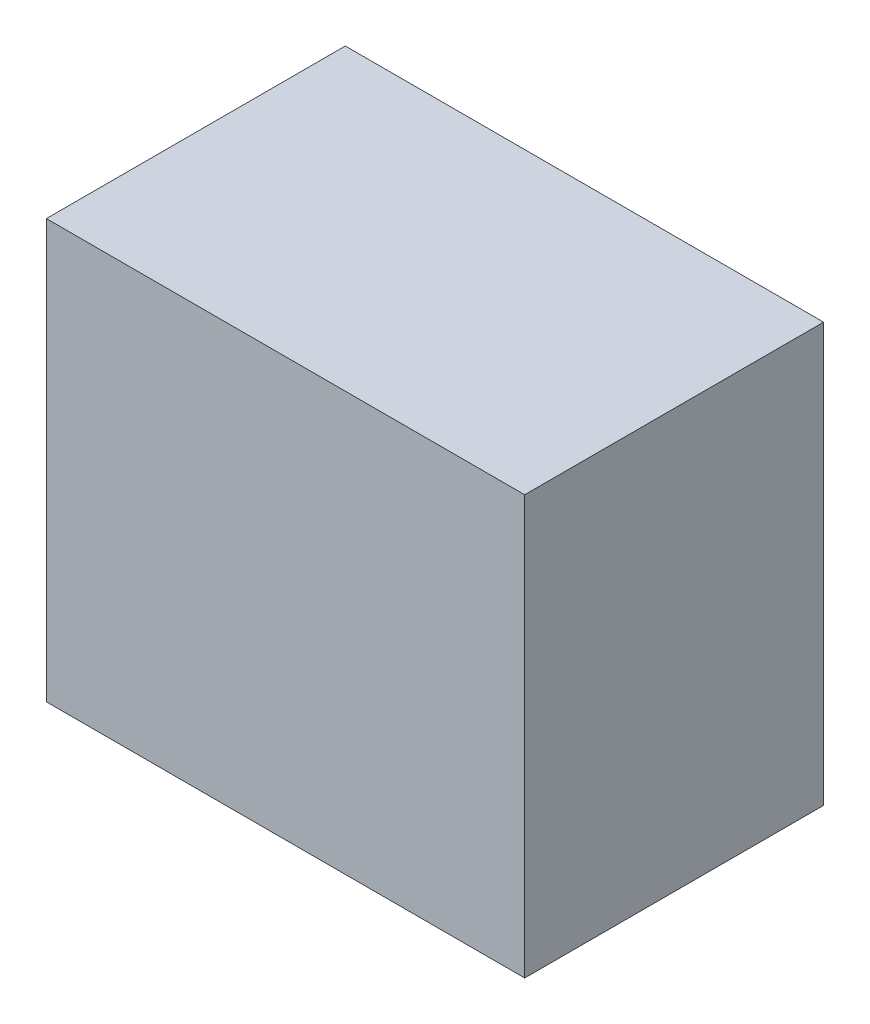
ISO-10303-21;
HEADER;
FILE_DESCRIPTION(('STEP AP214'),'2;1');
FILE_NAME('part.step','',(''),(''),'','','');
FILE_SCHEMA(('AUTOMOTIVE_DESIGN { 1 0 10303 214 1 1 1 1 }'));
ENDSEC;
DATA;
#1=APPLICATION_CONTEXT('core data for automotive mechanical design processes');
#2=APPLICATION_PROTOCOL_DEFINITION('international standard','automotive_design',2000,#1);
#3=PRODUCT_CONTEXT('',#1,'mechanical');
#4=PRODUCT('Part','Part','',(#3));
#5=PRODUCT_RELATED_PRODUCT_CATEGORY('part','',(#4));
#6=PRODUCT_DEFINITION_FORMATION('','',#4);
#7=PRODUCT_DEFINITION_CONTEXT('part definition',#1,'design');
#8=PRODUCT_DEFINITION('design','',#6,#7);
#9=PRODUCT_DEFINITION_SHAPE('','',#8);
#10=(LENGTH_UNIT() NAMED_UNIT(*) SI_UNIT(.MILLI.,.METRE.));
#11=(NAMED_UNIT(*) PLANE_ANGLE_UNIT() SI_UNIT($,.RADIAN.));
#12=(NAMED_UNIT(*) SI_UNIT($,.STERADIAN.) SOLID_ANGLE_UNIT());
#13=UNCERTAINTY_MEASURE_WITH_UNIT(LENGTH_MEASURE(1.E-05),#10,'distance_accuracy_value','');
#14=(GEOMETRIC_REPRESENTATION_CONTEXT(3) GLOBAL_UNCERTAINTY_ASSIGNED_CONTEXT((#13)) GLOBAL_UNIT_ASSIGNED_CONTEXT((#10,
#11,#12)) REPRESENTATION_CONTEXT('',''));
#15=CARTESIAN_POINT('',(0.,0.,0.));
#16=DIRECTION('',(0.,0.,1.));
#17=DIRECTION('',(1.,0.,0.));
#18=AXIS2_PLACEMENT_3D('',#15,#16,#17);
#19=CARTESIAN_POINT('',(40.,-35.,25.));
#20=DIRECTION('',(-1.,0.,0.));
#21=DIRECTION('',(0.,0.,1.));
#22=AXIS2_PLACEMENT_3D('',#19,#20,#21);
#23=PLANE('',#22);
#24=DIRECTION('',(0.,1.,0.));
#25=VECTOR('',#24,1.);
#26=CARTESIAN_POINT('',(40.,-35.,-25.));
#27=LINE('',#26,#25);
#28=CARTESIAN_POINT('',(40.,-35.,-25.));
#29=VERTEX_POINT('',#28);
#30=CARTESIAN_POINT('',(40.,35.,-25.));
#31=VERTEX_POINT('',#30);
#32=EDGE_CURVE('E99',#29,#31,#27,.T.);
#33=ORIENTED_EDGE('',*,*,#32,.T.);
#34=DIRECTION('',(0.,0.,-1.));
#35=VECTOR('',#34,1.);
#36=CARTESIAN_POINT('',(40.,35.,25.));
#37=LINE('',#36,#35);
#38=CARTESIAN_POINT('',(40.,35.,25.));
#39=VERTEX_POINT('',#38);
#40=EDGE_CURVE('E11',#39,#31,#37,.T.);
#41=ORIENTED_EDGE('',*,*,#40,.F.);
#42=DIRECTION('',(0.,1.,0.));
#43=VECTOR('',#42,1.);
#44=CARTESIAN_POINT('',(40.,-35.,25.));
#45=LINE('',#44,#43);
#46=CARTESIAN_POINT('',(40.,-35.,25.));
#47=VERTEX_POINT('',#46);
#48=EDGE_CURVE('E87',#47,#39,#45,.T.);
#49=ORIENTED_EDGE('',*,*,#48,.F.);
#50=DIRECTION('',(0.,0.,-1.));
#51=VECTOR('',#50,1.);
#52=CARTESIAN_POINT('',(40.,-35.,25.));
#53=LINE('',#52,#51);
#54=EDGE_CURVE('E95',#47,#29,#53,.T.);
#55=ORIENTED_EDGE('',*,*,#54,.T.);
#56=EDGE_LOOP('',(#33,#41,#49,#55));
#57=FACE_BOUND('',#56,.T.);
#58=ADVANCED_FACE('F36',(#57),#23,.F.);
#59=CARTESIAN_POINT('',(-40.,35.,25.));
#60=DIRECTION('',(0.,-1.,0.));
#61=DIRECTION('',(0.,0.,-1.));
#62=AXIS2_PLACEMENT_3D('',#59,#60,#61);
#63=PLANE('',#62);
#64=DIRECTION('',(-1.,0.,0.));
#65=VECTOR('',#64,1.);
#66=CARTESIAN_POINT('',(-40.,35.,-25.));
#67=LINE('',#66,#65);
#68=CARTESIAN_POINT('',(-40.,35.,-25.));
#69=VERTEX_POINT('',#68);
#70=EDGE_CURVE('E91',#31,#69,#67,.T.);
#71=ORIENTED_EDGE('',*,*,#70,.T.);
#72=DIRECTION('',(0.,0.,-1.));
#73=VECTOR('',#72,1.);
#74=CARTESIAN_POINT('',(-40.,35.,25.));
#75=LINE('',#74,#73);
#76=CARTESIAN_POINT('',(-40.,35.,25.));
#77=VERTEX_POINT('',#76);
#78=EDGE_CURVE('E44',#77,#69,#75,.T.);
#79=ORIENTED_EDGE('',*,*,#78,.F.);
#80=DIRECTION('',(-1.,0.,0.));
#81=VECTOR('',#80,1.);
#82=CARTESIAN_POINT('',(-40.,35.,25.));
#83=LINE('',#82,#81);
#84=EDGE_CURVE('E82',#39,#77,#83,.T.);
#85=ORIENTED_EDGE('',*,*,#84,.F.);
#86=ORIENTED_EDGE('',*,*,#40,.T.);
#87=EDGE_LOOP('',(#71,#79,#85,#86));
#88=FACE_BOUND('',#87,.T.);
#89=ADVANCED_FACE('F90',(#88),#63,.F.);
#90=CARTESIAN_POINT('',(-40.,-35.,25.));
#91=DIRECTION('',(1.,0.,0.));
#92=DIRECTION('',(0.,0.,-1.));
#93=AXIS2_PLACEMENT_3D('',#90,#91,#92);
#94=PLANE('',#93);
#95=DIRECTION('',(0.,-1.,0.));
#96=VECTOR('',#95,1.);
#97=CARTESIAN_POINT('',(-40.,-35.,-25.));
#98=LINE('',#97,#96);
#99=CARTESIAN_POINT('',(-40.,-35.,-25.));
#100=VERTEX_POINT('',#99);
#101=EDGE_CURVE('E69',#69,#100,#98,.T.);
#102=ORIENTED_EDGE('',*,*,#101,.T.);
#103=DIRECTION('',(0.,0.,-1.));
#104=VECTOR('',#103,1.);
#105=CARTESIAN_POINT('',(-40.,-35.,25.));
#106=LINE('',#105,#104);
#107=CARTESIAN_POINT('',(-40.,-35.,25.));
#108=VERTEX_POINT('',#107);
#109=EDGE_CURVE('E92',#108,#100,#106,.T.);
#110=ORIENTED_EDGE('',*,*,#109,.F.);
#111=DIRECTION('',(0.,-1.,0.));
#112=VECTOR('',#111,1.);
#113=CARTESIAN_POINT('',(-40.,-35.,25.));
#114=LINE('',#113,#112);
#115=EDGE_CURVE('E85',#77,#108,#114,.T.);
#116=ORIENTED_EDGE('',*,*,#115,.F.);
#117=ORIENTED_EDGE('',*,*,#78,.T.);
#118=EDGE_LOOP('',(#102,#110,#116,#117));
#119=FACE_BOUND('',#118,.T.);
#120=ADVANCED_FACE('F93',(#119),#94,.F.);
#121=CARTESIAN_POINT('',(-40.,-35.,25.));
#122=DIRECTION('',(0.,1.,0.));
#123=DIRECTION('',(0.,0.,1.));
#124=AXIS2_PLACEMENT_3D('',#121,#122,#123);
#125=PLANE('',#124);
#126=DIRECTION('',(1.,0.,0.));
#127=VECTOR('',#126,1.);
#128=CARTESIAN_POINT('',(-40.,-35.,-25.));
#129=LINE('',#128,#127);
#130=EDGE_CURVE('E75',#100,#29,#129,.T.);
#131=ORIENTED_EDGE('',*,*,#130,.T.);
#132=ORIENTED_EDGE('',*,*,#54,.F.);
#133=DIRECTION('',(1.,0.,0.));
#134=VECTOR('',#133,1.);
#135=CARTESIAN_POINT('',(-40.,-35.,25.));
#136=LINE('',#135,#134);
#137=EDGE_CURVE('E52',#108,#47,#136,.T.);
#138=ORIENTED_EDGE('',*,*,#137,.F.);
#139=ORIENTED_EDGE('',*,*,#109,.T.);
#140=EDGE_LOOP('',(#131,#132,#138,#139));
#141=FACE_BOUND('',#140,.T.);
#142=ADVANCED_FACE('F106',(#141),#125,.F.);
#143=CARTESIAN_POINT('',(0.,0.,25.));
#144=DIRECTION('',(0.,0.,-1.));
#145=DIRECTION('',(-1.,0.,0.));
#146=AXIS2_PLACEMENT_3D('',#143,#144,#145);
#147=PLANE('',#146);
#148=ORIENTED_EDGE('',*,*,#48,.T.);
#149=ORIENTED_EDGE('',*,*,#84,.T.);
#150=ORIENTED_EDGE('',*,*,#115,.T.);
#151=ORIENTED_EDGE('',*,*,#137,.T.);
#152=EDGE_LOOP('',(#148,#149,#150,#151));
#153=FACE_BOUND('',#152,.T.);
#154=ADVANCED_FACE('F83',(#153),#147,.F.);
#155=CARTESIAN_POINT('',(0.,0.,-25.));
#156=DIRECTION('',(0.,0.,-1.));
#157=DIRECTION('',(-1.,0.,0.));
#158=AXIS2_PLACEMENT_3D('',#155,#156,#157);
#159=PLANE('',#158);
#160=ORIENTED_EDGE('',*,*,#32,.F.);
#161=ORIENTED_EDGE('',*,*,#130,.F.);
#162=ORIENTED_EDGE('',*,*,#101,.F.);
#163=ORIENTED_EDGE('',*,*,#70,.F.);
#164=EDGE_LOOP('',(#160,#161,#162,#163));
#165=FACE_BOUND('',#164,.T.);
#166=ADVANCED_FACE('F109',(#165),#159,.T.);
#167=CLOSED_SHELL('',(#58,#89,#120,#142,#154,#166));
#168=MANIFOLD_SOLID_BREP('B2',#167);
#169=ADVANCED_BREP_SHAPE_REPRESENTATION('',(#18,#168),#14);
#170=SHAPE_DEFINITION_REPRESENTATION(#9,#169);
ENDSEC;
END-ISO-10303-21;
